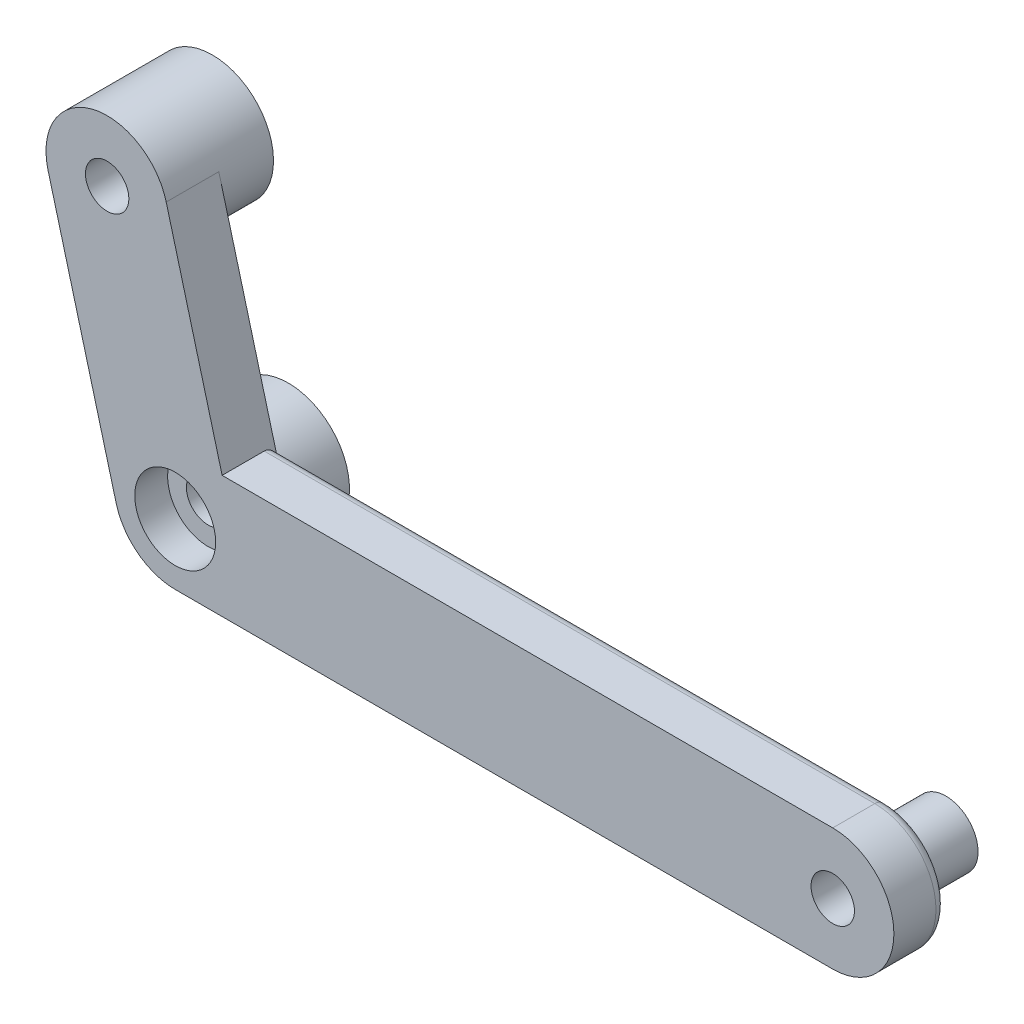
ISO-10303-21;
HEADER;
FILE_DESCRIPTION(('STEP AP214'),'2;1');
FILE_NAME('part.step','',(''),(''),'','','');
FILE_SCHEMA(('AUTOMOTIVE_DESIGN { 1 0 10303 214 1 1 1 1 }'));
ENDSEC;
DATA;
#1=APPLICATION_CONTEXT('core data for automotive mechanical design processes');
#2=APPLICATION_PROTOCOL_DEFINITION('international standard','automotive_design',2000,#1);
#3=PRODUCT_CONTEXT('',#1,'mechanical');
#4=PRODUCT('Part','Part','',(#3));
#5=PRODUCT_RELATED_PRODUCT_CATEGORY('part','',(#4));
#6=PRODUCT_DEFINITION_FORMATION('','',#4);
#7=PRODUCT_DEFINITION_CONTEXT('part definition',#1,'design');
#8=PRODUCT_DEFINITION('design','',#6,#7);
#9=PRODUCT_DEFINITION_SHAPE('','',#8);
#10=(LENGTH_UNIT() NAMED_UNIT(*) SI_UNIT(.MILLI.,.METRE.));
#11=(NAMED_UNIT(*) PLANE_ANGLE_UNIT() SI_UNIT($,.RADIAN.));
#12=(NAMED_UNIT(*) SI_UNIT($,.STERADIAN.) SOLID_ANGLE_UNIT());
#13=UNCERTAINTY_MEASURE_WITH_UNIT(LENGTH_MEASURE(1.E-05),#10,'distance_accuracy_value','');
#14=(GEOMETRIC_REPRESENTATION_CONTEXT(3) GLOBAL_UNCERTAINTY_ASSIGNED_CONTEXT((#13)) GLOBAL_UNIT_ASSIGNED_CONTEXT((#10,
#11,#12)) REPRESENTATION_CONTEXT('',''));
#15=CARTESIAN_POINT('',(0.,0.,0.));
#16=DIRECTION('',(0.,0.,1.));
#17=DIRECTION('',(1.,0.,0.));
#18=AXIS2_PLACEMENT_3D('',#15,#16,#17);
#19=CARTESIAN_POINT('',(-5.17638090205036,19.3185165257814,-30.5138944220067));
#20=DIRECTION('',(0.,0.,1.));
#21=DIRECTION('',(1.,0.,0.));
#22=AXIS2_PLACEMENT_3D('',#19,#20,#21);
#23=CYLINDRICAL_SURFACE('',#22,1.65);
#24=CARTESIAN_POINT('',(-5.17638090205036,19.3185165257814,2.));
#25=DIRECTION('',(0.,0.,1.));
#26=DIRECTION('',(1.,0.,0.));
#27=AXIS2_PLACEMENT_3D('',#24,#25,#26);
#28=CIRCLE('',#27,1.65);
#29=CARTESIAN_POINT('',(-3.52638090205036,19.3185165257814,2.));
#30=VERTEX_POINT('',#29);
#31=EDGE_CURVE('E151',#30,#30,#28,.T.);
#32=ORIENTED_EDGE('',*,*,#31,.T.);
#33=EDGE_LOOP('',(#32));
#34=FACE_BOUND('',#33,.T.);
#35=CARTESIAN_POINT('',(-5.17638090205036,19.3185165257814,-1.));
#36=DIRECTION('',(0.,0.,-1.));
#37=DIRECTION('',(-1.,0.,0.));
#38=AXIS2_PLACEMENT_3D('',#35,#36,#37);
#39=CIRCLE('',#38,1.65);
#40=CARTESIAN_POINT('',(-6.82638090205036,19.3185165257814,-1.));
#41=VERTEX_POINT('',#40);
#42=EDGE_CURVE('E46',#41,#41,#39,.F.);
#43=ORIENTED_EDGE('',*,*,#42,.F.);
#44=EDGE_LOOP('',(#43));
#45=FACE_BOUND('',#44,.T.);
#46=ADVANCED_FACE('F41',(#34,#45),#23,.F.);
#47=CARTESIAN_POINT('',(0.,0.,-2.));
#48=DIRECTION('',(0.,0.,-1.));
#49=DIRECTION('',(-1.,0.,0.));
#50=AXIS2_PLACEMENT_3D('',#47,#48,#49);
#51=PLANE('',#50);
#52=CARTESIAN_POINT('',(50.,0.,-2.));
#53=DIRECTION('',(0.,0.,-1.));
#54=DIRECTION('',(-1.,0.,0.));
#55=AXIS2_PLACEMENT_3D('',#52,#53,#54);
#56=CIRCLE('',#55,3.5);
#57=CARTESIAN_POINT('',(46.5,0.,-2.));
#58=VERTEX_POINT('',#57);
#59=EDGE_CURVE('E175',#58,#58,#56,.T.);
#60=ORIENTED_EDGE('',*,*,#59,.F.);
#61=EDGE_LOOP('',(#60));
#62=FACE_BOUND('',#61,.T.);
#63=DIRECTION('',(0.258819045102518,-0.965925826289069,0.));
#64=VECTOR('',#63,1.);
#65=CARTESIAN_POINT('',(-9.66793599429454,18.1150079660547,-2.));
#66=LINE('',#65,#64);
#67=CARTESIAN_POINT('',(-9.66793599429454,18.1150079660547,-2.));
#68=VERTEX_POINT('',#67);
#69=CARTESIAN_POINT('',(-4.49155509224418,-1.20350855972671,-2.));
#70=VERTEX_POINT('',#69);
#71=EDGE_CURVE('E122',#68,#70,#66,.T.);
#72=ORIENTED_EDGE('',*,*,#71,.F.);
#73=CARTESIAN_POINT('',(-5.17638090205036,19.3185165257814,-2.));
#74=DIRECTION('',(0.,0.,-1.));
#75=DIRECTION('',(-1.,0.,0.));
#76=AXIS2_PLACEMENT_3D('',#73,#74,#75);
#77=CIRCLE('',#76,4.65000000000001);
#78=CARTESIAN_POINT('',(-0.684825809806182,20.5220250855081,-2.));
#79=VERTEX_POINT('',#78);
#80=EDGE_CURVE('E115',#79,#68,#77,.T.);
#81=ORIENTED_EDGE('',*,*,#80,.F.);
#82=DIRECTION('',(-0.258819045102518,0.965925826289069,0.));
#83=VECTOR('',#82,1.);
#84=CARTESIAN_POINT('',(3.56807049410218,4.65,-2.));
#85=LINE('',#84,#83);
#86=CARTESIAN_POINT('',(3.78242984804708,3.85000000000001,-2.));
#87=VERTEX_POINT('',#86);
#88=EDGE_CURVE('E119',#87,#79,#85,.T.);
#89=ORIENTED_EDGE('',*,*,#88,.F.);
#90=DIRECTION('',(-1.,0.,0.));
#91=VECTOR('',#90,1.);
#92=CARTESIAN_POINT('',(50.,3.85,-2.));
#93=LINE('',#92,#91);
#94=CARTESIAN_POINT('',(50.,3.85,-2.));
#95=VERTEX_POINT('',#94);
#96=EDGE_CURVE('E211',#87,#95,#93,.F.);
#97=ORIENTED_EDGE('',*,*,#96,.T.);
#98=CARTESIAN_POINT('',(50.,0.,-2.));
#99=DIRECTION('',(0.,0.,-1.));
#100=DIRECTION('',(-1.,0.,0.));
#101=AXIS2_PLACEMENT_3D('',#98,#99,#100);
#102=CIRCLE('',#101,3.85);
#103=CARTESIAN_POINT('',(50.,-3.85,-2.));
#104=VERTEX_POINT('',#103);
#105=EDGE_CURVE('E209',#95,#104,#102,.T.);
#106=ORIENTED_EDGE('',*,*,#105,.T.);
#107=DIRECTION('',(1.,0.,0.));
#108=VECTOR('',#107,1.);
#109=CARTESIAN_POINT('',(0.,-3.85000000000001,-2.));
#110=LINE('',#109,#108);
#111=CARTESIAN_POINT('',(2.60768096208106,-3.85000000000001,-2.));
#112=VERTEX_POINT('',#111);
#113=EDGE_CURVE('E207',#104,#112,#110,.F.);
#114=ORIENTED_EDGE('',*,*,#113,.T.);
#115=CARTESIAN_POINT('',(0.,0.,-2.));
#116=DIRECTION('',(0.,0.,-1.));
#117=DIRECTION('',(-1.,0.,0.));
#118=AXIS2_PLACEMENT_3D('',#115,#116,#117);
#119=CIRCLE('',#118,4.65000000000001);
#120=EDGE_CURVE('E156',#70,#112,#119,.T.);
#121=ORIENTED_EDGE('',*,*,#120,.F.);
#122=EDGE_LOOP('',(#72,#81,#89,#97,#106,#114,#121));
#123=FACE_BOUND('',#122,.T.);
#124=ADVANCED_FACE('F117',(#62,#123),#51,.T.);
#125=CARTESIAN_POINT('',(0.,0.,2.));
#126=DIRECTION('',(0.,0.,-1.));
#127=DIRECTION('',(-1.,0.,0.));
#128=AXIS2_PLACEMENT_3D('',#125,#126,#127);
#129=CYLINDRICAL_SURFACE('',#128,1.65);
#130=CARTESIAN_POINT('',(0.,0.,-0.5));
#131=DIRECTION('',(0.,0.,1.));
#132=DIRECTION('',(1.,0.,0.));
#133=AXIS2_PLACEMENT_3D('',#130,#131,#132);
#134=CIRCLE('',#133,1.65);
#135=CARTESIAN_POINT('',(1.65,0.,-0.5));
#136=VERTEX_POINT('',#135);
#137=EDGE_CURVE('E165',#136,#136,#134,.T.);
#138=ORIENTED_EDGE('',*,*,#137,.T.);
#139=EDGE_LOOP('',(#138));
#140=FACE_BOUND('',#139,.T.);
#141=CARTESIAN_POINT('',(0.,0.,-6.6));
#142=DIRECTION('',(0.,0.,-1.));
#143=DIRECTION('',(-1.,0.,0.));
#144=AXIS2_PLACEMENT_3D('',#141,#142,#143);
#145=CIRCLE('',#144,1.65);
#146=CARTESIAN_POINT('',(-1.65,0.,-6.6));
#147=VERTEX_POINT('',#146);
#148=EDGE_CURVE('E158',#147,#147,#145,.T.);
#149=ORIENTED_EDGE('',*,*,#148,.T.);
#150=EDGE_LOOP('',(#149));
#151=FACE_BOUND('',#150,.T.);
#152=ADVANCED_FACE('F249',(#140,#151),#129,.F.);
#153=CARTESIAN_POINT('',(50.,0.,-2.4));
#154=DIRECTION('',(0.,0.,-1.));
#155=DIRECTION('',(-1.,0.,0.));
#156=AXIS2_PLACEMENT_3D('',#153,#154,#155);
#157=PLANE('',#156);
#158=CARTESIAN_POINT('',(50.,0.,-2.4));
#159=DIRECTION('',(0.,0.,-1.));
#160=DIRECTION('',(-1.,0.,0.));
#161=AXIS2_PLACEMENT_3D('',#158,#159,#160);
#162=CIRCLE('',#161,3.5);
#163=CARTESIAN_POINT('',(46.5,0.,-2.4));
#164=VERTEX_POINT('',#163);
#165=EDGE_CURVE('E178',#164,#164,#162,.T.);
#166=ORIENTED_EDGE('',*,*,#165,.T.);
#167=EDGE_LOOP('',(#166));
#168=FACE_BOUND('',#167,.T.);
#169=CARTESIAN_POINT('',(50.,0.,-2.4));
#170=DIRECTION('',(0.,0.,-1.));
#171=DIRECTION('',(-1.,0.,0.));
#172=AXIS2_PLACEMENT_3D('',#169,#170,#171);
#173=CIRCLE('',#172,2.45);
#174=CARTESIAN_POINT('',(47.55,0.,-2.4));
#175=VERTEX_POINT('',#174);
#176=EDGE_CURVE('E171',#175,#175,#173,.T.);
#177=ORIENTED_EDGE('',*,*,#176,.F.);
#178=EDGE_LOOP('',(#177));
#179=FACE_BOUND('',#178,.T.);
#180=ADVANCED_FACE('F279',(#168,#179),#157,.T.);
#181=CARTESIAN_POINT('',(0.,0.,2.));
#182=DIRECTION('',(0.,0.,-1.));
#183=DIRECTION('',(-1.,0.,0.));
#184=AXIS2_PLACEMENT_3D('',#181,#182,#183);
#185=PLANE('',#184);
#186=DIRECTION('',(0.258819045102518,-0.965925826289069,0.));
#187=VECTOR('',#186,1.);
#188=CARTESIAN_POINT('',(-9.66793599429454,18.1150079660547,2.));
#189=LINE('',#188,#187);
#190=CARTESIAN_POINT('',(-9.66793599429454,18.1150079660547,2.));
#191=VERTEX_POINT('',#190);
#192=CARTESIAN_POINT('',(-4.49155509224418,-1.20350855972671,2.));
#193=VERTEX_POINT('',#192);
#194=EDGE_CURVE('E161',#191,#193,#189,.T.);
#195=ORIENTED_EDGE('',*,*,#194,.T.);
#196=CARTESIAN_POINT('',(0.,0.,2.));
#197=DIRECTION('',(0.,0.,1.));
#198=DIRECTION('',(-1.,0.,0.));
#199=AXIS2_PLACEMENT_3D('',#196,#197,#198);
#200=CIRCLE('',#199,4.65000000000001);
#201=CARTESIAN_POINT('',(0.,-4.65000000000001,2.));
#202=VERTEX_POINT('',#201);
#203=EDGE_CURVE('E186',#193,#202,#200,.T.);
#204=ORIENTED_EDGE('',*,*,#203,.T.);
#205=DIRECTION('',(1.,0.,0.));
#206=VECTOR('',#205,1.);
#207=CARTESIAN_POINT('',(50.,-4.65,2.));
#208=LINE('',#207,#206);
#209=CARTESIAN_POINT('',(50.,-4.65,2.));
#210=VERTEX_POINT('',#209);
#211=EDGE_CURVE('E188',#202,#210,#208,.T.);
#212=ORIENTED_EDGE('',*,*,#211,.T.);
#213=CARTESIAN_POINT('',(50.,0.,2.));
#214=DIRECTION('',(0.,0.,1.));
#215=DIRECTION('',(-1.,0.,0.));
#216=AXIS2_PLACEMENT_3D('',#213,#214,#215);
#217=CIRCLE('',#216,4.65);
#218=CARTESIAN_POINT('',(50.,4.65,2.));
#219=VERTEX_POINT('',#218);
#220=EDGE_CURVE('E190',#210,#219,#217,.T.);
#221=ORIENTED_EDGE('',*,*,#220,.T.);
#222=DIRECTION('',(-1.,0.,0.));
#223=VECTOR('',#222,1.);
#224=CARTESIAN_POINT('',(0.,4.65000000000001,2.));
#225=LINE('',#224,#223);
#226=CARTESIAN_POINT('',(3.56807049410218,4.65000000000001,2.));
#227=VERTEX_POINT('',#226);
#228=EDGE_CURVE('E192',#219,#227,#225,.T.);
#229=ORIENTED_EDGE('',*,*,#228,.T.);
#230=DIRECTION('',(-0.258819045102518,0.965925826289069,0.));
#231=VECTOR('',#230,1.);
#232=CARTESIAN_POINT('',(3.56807049410218,4.65,2.));
#233=LINE('',#232,#231);
#234=CARTESIAN_POINT('',(-0.684825809806184,20.5220250855081,2.));
#235=VERTEX_POINT('',#234);
#236=EDGE_CURVE('E317',#227,#235,#233,.T.);
#237=ORIENTED_EDGE('',*,*,#236,.T.);
#238=CARTESIAN_POINT('',(-5.17638090205036,19.3185165257814,2.));
#239=DIRECTION('',(0.,0.,1.));
#240=DIRECTION('',(-1.,0.,0.));
#241=AXIS2_PLACEMENT_3D('',#238,#239,#240);
#242=CIRCLE('',#241,4.65000000000001);
#243=EDGE_CURVE('E132',#235,#191,#242,.T.);
#244=ORIENTED_EDGE('',*,*,#243,.T.);
#245=EDGE_LOOP('',(#195,#204,#212,#221,#229,#237,#244));
#246=FACE_BOUND('',#245,.T.);
#247=CARTESIAN_POINT('',(0.,0.,2.));
#248=DIRECTION('',(0.,0.,1.));
#249=DIRECTION('',(1.,0.,0.));
#250=AXIS2_PLACEMENT_3D('',#247,#248,#249);
#251=CIRCLE('',#250,3.075);
#252=CARTESIAN_POINT('',(3.075,0.,2.));
#253=VERTEX_POINT('',#252);
#254=EDGE_CURVE('E155',#253,#253,#251,.T.);
#255=ORIENTED_EDGE('',*,*,#254,.F.);
#256=EDGE_LOOP('',(#255));
#257=FACE_BOUND('',#256,.T.);
#258=CARTESIAN_POINT('',(50.,0.,2.));
#259=DIRECTION('',(0.,0.,1.));
#260=DIRECTION('',(1.,0.,0.));
#261=AXIS2_PLACEMENT_3D('',#258,#259,#260);
#262=CIRCLE('',#261,1.65);
#263=CARTESIAN_POINT('',(51.65,0.,2.));
#264=VERTEX_POINT('',#263);
#265=EDGE_CURVE('E181',#264,#264,#262,.T.);
#266=ORIENTED_EDGE('',*,*,#265,.F.);
#267=EDGE_LOOP('',(#266));
#268=FACE_BOUND('',#267,.T.);
#269=ORIENTED_EDGE('',*,*,#31,.F.);
#270=EDGE_LOOP('',(#269));
#271=FACE_BOUND('',#270,.T.);
#272=ADVANCED_FACE('F229',(#246,#257,#268,#271),#185,.F.);
#273=CARTESIAN_POINT('',(0.,0.,2.));
#274=DIRECTION('',(0.,0.,-1.));
#275=DIRECTION('',(-1.,0.,0.));
#276=AXIS2_PLACEMENT_3D('',#273,#274,#275);
#277=CYLINDRICAL_SURFACE('',#276,4.65000000000001);
#278=ORIENTED_EDGE('',*,*,#203,.F.);
#279=DIRECTION('',(0.,0.,1.));
#280=VECTOR('',#279,1.);
#281=CARTESIAN_POINT('',(-4.49155509224418,-1.20350855972671,-30.5138944220067));
#282=LINE('',#281,#280);
#283=EDGE_CURVE('E143',#70,#193,#282,.T.);
#284=ORIENTED_EDGE('',*,*,#283,.F.);
#285=ORIENTED_EDGE('',*,*,#120,.T.);
#286=CARTESIAN_POINT('',(2.60768096208106,-3.85000000000001,-2.));
#287=CARTESIAN_POINT('',(2.5513965252021,-3.88813137176407,-1.99996722502636));
#288=CARTESIAN_POINT('',(2.49432087615377,-3.92498071993976,-1.99727709721067));
#289=CARTESIAN_POINT('',(2.37898870856653,-3.99593171285262,-1.98739878891353));
#290=CARTESIAN_POINT('',(2.32073434321973,-4.03003788547599,-1.98021819980612));
#291=CARTESIAN_POINT('',(2.20358244707727,-4.09526565632877,-1.96222044302445));
#292=CARTESIAN_POINT('',(2.14469032392126,-4.12640285649458,-1.95142380524581));
#293=CARTESIAN_POINT('',(2.02611438187092,-4.18590056123308,-1.92677933604008));
#294=CARTESIAN_POINT('',(1.96643010844688,-4.21425938579435,-1.91292967477712));
#295=CARTESIAN_POINT('',(1.80093924809649,-4.28864672714957,-1.87122884887268));
#296=CARTESIAN_POINT('',(1.69447909826136,-4.33176651109045,-1.84072438234376));
#297=CARTESIAN_POINT('',(1.48029183010364,-4.40956231079718,-1.77403250103863));
#298=CARTESIAN_POINT('',(1.37256408539743,-4.4442339509555,-1.73784215722787));
#299=CARTESIAN_POINT('',(1.04738977003664,-4.5361105994101,-1.6229669528191));
#300=CARTESIAN_POINT('',(0.828476483261017,-4.58094551480499,-1.53812626936352));
#301=CARTESIAN_POINT('',(0.509799811949458,-4.62305646126751,-1.41010805397757));
#302=CARTESIAN_POINT('',(0.410362390780079,-4.6329321901987,-1.36952593129161));
#303=CARTESIAN_POINT('',(0.211472913276468,-4.64625532318511,-1.28770315979258));
#304=CARTESIAN_POINT('',(0.112021166643062,-4.64971358046947,-1.24646374198126));
#305=CARTESIAN_POINT('',(0.00839829202350861,-4.64999431212968,-1.20348344531256));
#306=CARTESIAN_POINT('',(0.00419911645483577,-4.65000000000074,-1.20174170819417));
#307=CARTESIAN_POINT('',(0.,-4.65000000000001,-1.2));
#308=B_SPLINE_CURVE_WITH_KNOTS('',3,(#286,#287,#288,#289,#290,#291,#292,#293,#294,#295,#296,
#297,#298,#299,#300,#301,#302,#303,#304,#305,#306,#307),.UNSPECIFIED.,.F.,.F.,(4,2,2,2,2,2,2,2,
2,2,4),(0.,0.203795375207023,0.407247150944995,0.609562887954329,0.812000214607053,
1.16795216229696,1.52408808069821,2.23811721837387,2.5615716210759,2.8844784973427,
2.89811668971625),.UNSPECIFIED.);
#309=CARTESIAN_POINT('',(0.,-4.65000000000001,-1.2));
#310=VERTEX_POINT('',#309);
#311=EDGE_CURVE('E11',#112,#310,#308,.T.);
#312=ORIENTED_EDGE('',*,*,#311,.T.);
#313=DIRECTION('',(0.,0.,-1.));
#314=VECTOR('',#313,1.);
#315=CARTESIAN_POINT('',(0.,-4.65000000000001,2.));
#316=LINE('',#315,#314);
#317=EDGE_CURVE('E200',#202,#310,#316,.T.);
#318=ORIENTED_EDGE('',*,*,#317,.F.);
#319=EDGE_LOOP('',(#278,#284,#285,#312,#318));
#320=FACE_BOUND('',#319,.T.);
#321=CARTESIAN_POINT('',(0.,0.,-6.6));
#322=DIRECTION('',(0.,0.,-1.));
#323=DIRECTION('',(-1.,0.,0.));
#324=AXIS2_PLACEMENT_3D('',#321,#322,#323);
#325=CIRCLE('',#324,4.65000000000001);
#326=CARTESIAN_POINT('',(-4.65000000000001,0.,-6.6));
#327=VERTEX_POINT('',#326);
#328=EDGE_CURVE('E152',#327,#327,#325,.T.);
#329=ORIENTED_EDGE('',*,*,#328,.F.);
#330=EDGE_LOOP('',(#329));
#331=FACE_BOUND('',#330,.T.);
#332=ADVANCED_FACE('F223',(#320,#331),#277,.T.);
#333=CARTESIAN_POINT('',(50.,-4.65,2.));
#334=DIRECTION('',(0.,1.,0.));
#335=DIRECTION('',(-1.,0.,0.));
#336=AXIS2_PLACEMENT_3D('',#333,#334,#335);
#337=PLANE('',#336);
#338=ORIENTED_EDGE('',*,*,#317,.T.);
#339=DIRECTION('',(1.,0.,0.));
#340=VECTOR('',#339,1.);
#341=CARTESIAN_POINT('',(50.,-4.65,-1.2));
#342=LINE('',#341,#340);
#343=CARTESIAN_POINT('',(50.,-4.65,-1.2));
#344=VERTEX_POINT('',#343);
#345=EDGE_CURVE('E64',#310,#344,#342,.T.);
#346=ORIENTED_EDGE('',*,*,#345,.T.);
#347=DIRECTION('',(0.,0.,-1.));
#348=VECTOR('',#347,1.);
#349=CARTESIAN_POINT('',(50.,-4.65,2.));
#350=LINE('',#349,#348);
#351=EDGE_CURVE('E198',#210,#344,#350,.T.);
#352=ORIENTED_EDGE('',*,*,#351,.F.);
#353=ORIENTED_EDGE('',*,*,#211,.F.);
#354=EDGE_LOOP('',(#338,#346,#352,#353));
#355=FACE_BOUND('',#354,.T.);
#356=ADVANCED_FACE('F228',(#355),#337,.F.);
#357=CARTESIAN_POINT('',(50.,0.,2.));
#358=DIRECTION('',(0.,0.,-1.));
#359=DIRECTION('',(-1.,0.,0.));
#360=AXIS2_PLACEMENT_3D('',#357,#358,#359);
#361=CYLINDRICAL_SURFACE('',#360,4.65);
#362=ORIENTED_EDGE('',*,*,#351,.T.);
#363=CARTESIAN_POINT('',(50.,0.,-1.2));
#364=DIRECTION('',(0.,0.,-1.));
#365=DIRECTION('',(-1.,0.,0.));
#366=AXIS2_PLACEMENT_3D('',#363,#364,#365);
#367=CIRCLE('',#366,4.65);
#368=CARTESIAN_POINT('',(50.,4.65,-1.2));
#369=VERTEX_POINT('',#368);
#370=EDGE_CURVE('E213',#344,#369,#367,.F.);
#371=ORIENTED_EDGE('',*,*,#370,.T.);
#372=DIRECTION('',(0.,0.,-1.));
#373=VECTOR('',#372,1.);
#374=CARTESIAN_POINT('',(50.,4.65,2.));
#375=LINE('',#374,#373);
#376=EDGE_CURVE('E195',#219,#369,#375,.T.);
#377=ORIENTED_EDGE('',*,*,#376,.F.);
#378=ORIENTED_EDGE('',*,*,#220,.F.);
#379=EDGE_LOOP('',(#362,#371,#377,#378));
#380=FACE_BOUND('',#379,.T.);
#381=ADVANCED_FACE('F298',(#380),#361,.T.);
#382=CARTESIAN_POINT('',(0.,4.65000000000001,2.));
#383=DIRECTION('',(0.,-1.,0.));
#384=DIRECTION('',(1.,0.,0.));
#385=AXIS2_PLACEMENT_3D('',#382,#383,#384);
#386=PLANE('',#385);
#387=ORIENTED_EDGE('',*,*,#376,.T.);
#388=DIRECTION('',(-1.,0.,0.));
#389=VECTOR('',#388,1.);
#390=CARTESIAN_POINT('',(3.56807049410218,4.65000000000001,-1.2));
#391=LINE('',#390,#389);
#392=CARTESIAN_POINT('',(3.56807049410218,4.65,-1.2));
#393=VERTEX_POINT('',#392);
#394=EDGE_CURVE('E202',#369,#393,#391,.T.);
#395=ORIENTED_EDGE('',*,*,#394,.T.);
#396=DIRECTION('',(0.,0.,1.));
#397=VECTOR('',#396,1.);
#398=CARTESIAN_POINT('',(3.56807049410218,4.65,-30.5138944220067));
#399=LINE('',#398,#397);
#400=EDGE_CURVE('E136',#393,#227,#399,.T.);
#401=ORIENTED_EDGE('',*,*,#400,.T.);
#402=ORIENTED_EDGE('',*,*,#228,.F.);
#403=EDGE_LOOP('',(#387,#395,#401,#402));
#404=FACE_BOUND('',#403,.T.);
#405=ADVANCED_FACE('F292',(#404),#386,.F.);
#406=CARTESIAN_POINT('',(50.,0.,2.));
#407=DIRECTION('',(0.,0.,-1.));
#408=DIRECTION('',(-1.,0.,0.));
#409=AXIS2_PLACEMENT_3D('',#406,#407,#408);
#410=CYLINDRICAL_SURFACE('',#409,1.65);
#411=ORIENTED_EDGE('',*,*,#265,.T.);
#412=EDGE_LOOP('',(#411));
#413=FACE_BOUND('',#412,.T.);
#414=CARTESIAN_POINT('',(50.,0.,-6.6));
#415=DIRECTION('',(0.,0.,-1.));
#416=DIRECTION('',(-1.,0.,0.));
#417=AXIS2_PLACEMENT_3D('',#414,#415,#416);
#418=CIRCLE('',#417,1.65);
#419=CARTESIAN_POINT('',(48.35,0.,-6.6));
#420=VERTEX_POINT('',#419);
#421=EDGE_CURVE('E168',#420,#420,#418,.T.);
#422=ORIENTED_EDGE('',*,*,#421,.T.);
#423=EDGE_LOOP('',(#422));
#424=FACE_BOUND('',#423,.T.);
#425=ADVANCED_FACE('F285',(#413,#424),#410,.F.);
#426=CARTESIAN_POINT('',(50.,0.,-2.4));
#427=DIRECTION('',(0.,0.,1.));
#428=DIRECTION('',(1.,0.,0.));
#429=AXIS2_PLACEMENT_3D('',#426,#427,#428);
#430=CYLINDRICAL_SURFACE('',#429,3.5);
#431=ORIENTED_EDGE('',*,*,#165,.F.);
#432=EDGE_LOOP('',(#431));
#433=FACE_BOUND('',#432,.T.);
#434=ORIENTED_EDGE('',*,*,#59,.T.);
#435=EDGE_LOOP('',(#434));
#436=FACE_BOUND('',#435,.T.);
#437=ADVANCED_FACE('F274',(#433,#436),#430,.T.);
#438=CARTESIAN_POINT('',(50.,0.,-6.6));
#439=DIRECTION('',(0.,0.,-1.));
#440=DIRECTION('',(-1.,0.,0.));
#441=AXIS2_PLACEMENT_3D('',#438,#439,#440);
#442=PLANE('',#441);
#443=CARTESIAN_POINT('',(50.,0.,-6.6));
#444=DIRECTION('',(0.,0.,-1.));
#445=DIRECTION('',(-1.,0.,0.));
#446=AXIS2_PLACEMENT_3D('',#443,#444,#445);
#447=CIRCLE('',#446,2.45);
#448=CARTESIAN_POINT('',(47.55,0.,-6.6));
#449=VERTEX_POINT('',#448);
#450=EDGE_CURVE('E172',#449,#449,#447,.T.);
#451=ORIENTED_EDGE('',*,*,#450,.T.);
#452=EDGE_LOOP('',(#451));
#453=FACE_BOUND('',#452,.T.);
#454=ORIENTED_EDGE('',*,*,#421,.F.);
#455=EDGE_LOOP('',(#454));
#456=FACE_BOUND('',#455,.T.);
#457=ADVANCED_FACE('F271',(#453,#456),#442,.T.);
#458=CARTESIAN_POINT('',(50.,0.,-6.6));
#459=DIRECTION('',(0.,0.,1.));
#460=DIRECTION('',(1.,0.,0.));
#461=AXIS2_PLACEMENT_3D('',#458,#459,#460);
#462=CYLINDRICAL_SURFACE('',#461,2.45);
#463=ORIENTED_EDGE('',*,*,#450,.F.);
#464=EDGE_LOOP('',(#463));
#465=FACE_BOUND('',#464,.T.);
#466=ORIENTED_EDGE('',*,*,#176,.T.);
#467=EDGE_LOOP('',(#466));
#468=FACE_BOUND('',#467,.T.);
#469=ADVANCED_FACE('F269',(#465,#468),#462,.T.);
#470=CARTESIAN_POINT('',(0.,0.,-0.5));
#471=DIRECTION('',(0.,0.,1.));
#472=DIRECTION('',(1.,0.,0.));
#473=AXIS2_PLACEMENT_3D('',#470,#471,#472);
#474=CYLINDRICAL_SURFACE('',#473,3.075);
#475=CARTESIAN_POINT('',(0.,0.,-0.5));
#476=DIRECTION('',(0.,0.,1.));
#477=DIRECTION('',(1.,0.,0.));
#478=AXIS2_PLACEMENT_3D('',#475,#476,#477);
#479=CIRCLE('',#478,3.075);
#480=CARTESIAN_POINT('',(3.075,0.,-0.5));
#481=VERTEX_POINT('',#480);
#482=EDGE_CURVE('E162',#481,#481,#479,.T.);
#483=ORIENTED_EDGE('',*,*,#482,.F.);
#484=EDGE_LOOP('',(#483));
#485=FACE_BOUND('',#484,.T.);
#486=ORIENTED_EDGE('',*,*,#254,.T.);
#487=EDGE_LOOP('',(#486));
#488=FACE_BOUND('',#487,.T.);
#489=ADVANCED_FACE('F265',(#485,#488),#474,.F.);
#490=CARTESIAN_POINT('',(0.,0.,-0.5));
#491=DIRECTION('',(0.,0.,1.));
#492=DIRECTION('',(1.,0.,0.));
#493=AXIS2_PLACEMENT_3D('',#490,#491,#492);
#494=PLANE('',#493);
#495=ORIENTED_EDGE('',*,*,#137,.F.);
#496=EDGE_LOOP('',(#495));
#497=FACE_BOUND('',#496,.T.);
#498=ORIENTED_EDGE('',*,*,#482,.T.);
#499=EDGE_LOOP('',(#498));
#500=FACE_BOUND('',#499,.T.);
#501=ADVANCED_FACE('F261',(#497,#500),#494,.T.);
#502=CARTESIAN_POINT('',(50.,0.,-6.6));
#503=DIRECTION('',(0.,0.,-1.));
#504=DIRECTION('',(-1.,0.,0.));
#505=AXIS2_PLACEMENT_3D('',#502,#503,#504);
#506=PLANE('',#505);
#507=ORIENTED_EDGE('',*,*,#148,.F.);
#508=EDGE_LOOP('',(#507));
#509=FACE_BOUND('',#508,.T.);
#510=ORIENTED_EDGE('',*,*,#328,.T.);
#511=EDGE_LOOP('',(#510));
#512=FACE_BOUND('',#511,.T.);
#513=ADVANCED_FACE('F258',(#509,#512),#506,.T.);
#514=CARTESIAN_POINT('',(-9.66793599429454,18.1150079660547,-30.5138944220067));
#515=DIRECTION('',(-0.965925826289069,-0.258819045102518,0.));
#516=DIRECTION('',(0.258819045102518,-0.965925826289069,0.));
#517=AXIS2_PLACEMENT_3D('',#514,#515,#516);
#518=PLANE('',#517);
#519=DIRECTION('',(0.,0.,1.));
#520=VECTOR('',#519,1.);
#521=CARTESIAN_POINT('',(-9.66793599429454,18.1150079660547,-30.5138944220067));
#522=LINE('',#521,#520);
#523=EDGE_CURVE('E141',#68,#191,#522,.T.);
#524=ORIENTED_EDGE('',*,*,#523,.F.);
#525=ORIENTED_EDGE('',*,*,#71,.T.);
#526=ORIENTED_EDGE('',*,*,#283,.T.);
#527=ORIENTED_EDGE('',*,*,#194,.F.);
#528=EDGE_LOOP('',(#524,#525,#526,#527));
#529=FACE_BOUND('',#528,.T.);
#530=ADVANCED_FACE('F256',(#529),#518,.T.);
#531=CARTESIAN_POINT('',(-5.17638090205036,19.3185165257814,-30.5138944220067));
#532=DIRECTION('',(0.,0.,1.));
#533=DIRECTION('',(1.,0.,0.));
#534=AXIS2_PLACEMENT_3D('',#531,#532,#533);
#535=CYLINDRICAL_SURFACE('',#534,4.65000000000001);
#536=DIRECTION('',(0.,0.,1.));
#537=VECTOR('',#536,1.);
#538=CARTESIAN_POINT('',(-0.684825809806184,20.5220250855081,-30.5138944220067));
#539=LINE('',#538,#537);
#540=EDGE_CURVE('E128',#79,#235,#539,.T.);
#541=ORIENTED_EDGE('',*,*,#540,.F.);
#542=ORIENTED_EDGE('',*,*,#80,.T.);
#543=ORIENTED_EDGE('',*,*,#523,.T.);
#544=ORIENTED_EDGE('',*,*,#243,.F.);
#545=EDGE_LOOP('',(#541,#542,#543,#544));
#546=FACE_BOUND('',#545,.T.);
#547=CARTESIAN_POINT('',(-5.17638090205036,19.3185165257814,-6.));
#548=DIRECTION('',(0.,0.,-1.));
#549=DIRECTION('',(-1.,0.,0.));
#550=AXIS2_PLACEMENT_3D('',#547,#548,#549);
#551=CIRCLE('',#550,4.65000000000001);
#552=CARTESIAN_POINT('',(-9.82638090205037,19.3185165257814,-6.));
#553=VERTEX_POINT('',#552);
#554=EDGE_CURVE('E125',#553,#553,#551,.T.);
#555=ORIENTED_EDGE('',*,*,#554,.F.);
#556=EDGE_LOOP('',(#555));
#557=FACE_BOUND('',#556,.T.);
#558=ADVANCED_FACE('F129',(#546,#557),#535,.T.);
#559=CARTESIAN_POINT('',(3.56807049410218,4.65,-30.5138944220067));
#560=DIRECTION('',(0.965925826289069,0.258819045102518,0.));
#561=DIRECTION('',(-0.258819045102518,0.965925826289069,0.));
#562=AXIS2_PLACEMENT_3D('',#559,#560,#561);
#563=PLANE('',#562);
#564=ORIENTED_EDGE('',*,*,#400,.F.);
#565=CARTESIAN_POINT('',(3.78242984804708,3.85000000000001,-1.2));
#566=DIRECTION('',(0.965925826289069,0.258819045102518,0.));
#567=DIRECTION('',(0.258819045102518,-0.965925826289069,0.));
#568=AXIS2_PLACEMENT_3D('',#565,#566,#567);
#569=ELLIPSE('',#568,0.828220944328066,0.8);
#570=EDGE_CURVE('E51',#393,#87,#569,.F.);
#571=ORIENTED_EDGE('',*,*,#570,.T.);
#572=ORIENTED_EDGE('',*,*,#88,.T.);
#573=ORIENTED_EDGE('',*,*,#540,.T.);
#574=ORIENTED_EDGE('',*,*,#236,.F.);
#575=EDGE_LOOP('',(#564,#571,#572,#573,#574));
#576=FACE_BOUND('',#575,.T.);
#577=ADVANCED_FACE('F139',(#576),#563,.T.);
#578=CARTESIAN_POINT('',(50.,-3.85,-1.2));
#579=DIRECTION('',(-1.,0.,0.));
#580=DIRECTION('',(0.,-1.,0.));
#581=AXIS2_PLACEMENT_3D('',#578,#579,#580);
#582=CYLINDRICAL_SURFACE('',#581,0.8);
#583=ORIENTED_EDGE('',*,*,#311,.F.);
#584=ORIENTED_EDGE('',*,*,#113,.F.);
#585=CARTESIAN_POINT('',(50.,-3.85,-1.2));
#586=DIRECTION('',(1.,0.,0.));
#587=DIRECTION('',(0.,0.,-1.));
#588=AXIS2_PLACEMENT_3D('',#585,#586,#587);
#589=CIRCLE('',#588,0.8);
#590=EDGE_CURVE('E311',#344,#104,#589,.T.);
#591=ORIENTED_EDGE('',*,*,#590,.F.);
#592=ORIENTED_EDGE('',*,*,#345,.F.);
#593=EDGE_LOOP('',(#583,#584,#591,#592));
#594=FACE_BOUND('',#593,.T.);
#595=ADVANCED_FACE('F43',(#594),#582,.T.);
#596=CARTESIAN_POINT('',(50.,0.,-1.2));
#597=DIRECTION('',(0.,0.,-1.));
#598=DIRECTION('',(-1.,0.,0.));
#599=AXIS2_PLACEMENT_3D('',#596,#597,#598);
#600=TOROIDAL_SURFACE('',#599,3.85,0.8);
#601=ORIENTED_EDGE('',*,*,#590,.T.);
#602=ORIENTED_EDGE('',*,*,#105,.F.);
#603=CARTESIAN_POINT('',(50.,3.85,-1.2));
#604=DIRECTION('',(-1.,0.,0.));
#605=DIRECTION('',(0.,0.,1.));
#606=AXIS2_PLACEMENT_3D('',#603,#604,#605);
#607=CIRCLE('',#606,0.8);
#608=EDGE_CURVE('E222',#369,#95,#607,.T.);
#609=ORIENTED_EDGE('',*,*,#608,.F.);
#610=ORIENTED_EDGE('',*,*,#370,.F.);
#611=EDGE_LOOP('',(#601,#602,#609,#610));
#612=FACE_BOUND('',#611,.T.);
#613=ADVANCED_FACE('F234',(#612),#600,.T.);
#614=CARTESIAN_POINT('',(0.,3.85000000000001,-1.2));
#615=DIRECTION('',(1.,0.,0.));
#616=DIRECTION('',(0.,1.,0.));
#617=AXIS2_PLACEMENT_3D('',#614,#615,#616);
#618=CYLINDRICAL_SURFACE('',#617,0.8);
#619=ORIENTED_EDGE('',*,*,#608,.T.);
#620=ORIENTED_EDGE('',*,*,#96,.F.);
#621=ORIENTED_EDGE('',*,*,#570,.F.);
#622=ORIENTED_EDGE('',*,*,#394,.F.);
#623=EDGE_LOOP('',(#619,#620,#621,#622));
#624=FACE_BOUND('',#623,.T.);
#625=ADVANCED_FACE('F231',(#624),#618,.T.);
#626=CARTESIAN_POINT('',(-5.17638090205036,19.3185165257814,-6.));
#627=DIRECTION('',(0.,0.,-1.));
#628=DIRECTION('',(-1.,0.,0.));
#629=AXIS2_PLACEMENT_3D('',#626,#627,#628);
#630=PLANE('',#629);
#631=CARTESIAN_POINT('',(-5.17638090205036,19.3185165257814,-6.));
#632=DIRECTION('',(0.,0.,-1.));
#633=DIRECTION('',(-1.,0.,0.));
#634=AXIS2_PLACEMENT_3D('',#631,#632,#633);
#635=CIRCLE('',#634,2.1);
#636=CARTESIAN_POINT('',(-7.27638090205036,19.3185165257814,-6.));
#637=VERTEX_POINT('',#636);
#638=EDGE_CURVE('E325',#637,#637,#635,.T.);
#639=ORIENTED_EDGE('',*,*,#638,.F.);
#640=EDGE_LOOP('',(#639));
#641=FACE_BOUND('',#640,.T.);
#642=ORIENTED_EDGE('',*,*,#554,.T.);
#643=EDGE_LOOP('',(#642));
#644=FACE_BOUND('',#643,.T.);
#645=ADVANCED_FACE('F233',(#641,#644),#630,.T.);
#646=CARTESIAN_POINT('',(-5.17638090205036,19.3185165257814,-1.));
#647=DIRECTION('',(0.,0.,-1.));
#648=DIRECTION('',(-1.,0.,0.));
#649=AXIS2_PLACEMENT_3D('',#646,#647,#648);
#650=PLANE('',#649);
#651=CARTESIAN_POINT('',(-5.17638090205036,19.3185165257814,-1.));
#652=DIRECTION('',(0.,0.,-1.));
#653=DIRECTION('',(-1.,0.,0.));
#654=AXIS2_PLACEMENT_3D('',#651,#652,#653);
#655=CIRCLE('',#654,2.1);
#656=CARTESIAN_POINT('',(-7.27638090205036,19.3185165257814,-1.));
#657=VERTEX_POINT('',#656);
#658=EDGE_CURVE('E328',#657,#657,#655,.T.);
#659=ORIENTED_EDGE('',*,*,#658,.T.);
#660=EDGE_LOOP('',(#659));
#661=FACE_BOUND('',#660,.T.);
#662=ORIENTED_EDGE('',*,*,#42,.T.);
#663=EDGE_LOOP('',(#662));
#664=FACE_BOUND('',#663,.T.);
#665=ADVANCED_FACE('F335',(#661,#664),#650,.T.);
#666=CARTESIAN_POINT('',(-5.17638090205036,19.3185165257814,-1.));
#667=DIRECTION('',(0.,0.,-1.));
#668=DIRECTION('',(-1.,0.,0.));
#669=AXIS2_PLACEMENT_3D('',#666,#667,#668);
#670=CYLINDRICAL_SURFACE('',#669,2.1);
#671=ORIENTED_EDGE('',*,*,#658,.F.);
#672=EDGE_LOOP('',(#671));
#673=FACE_BOUND('',#672,.T.);
#674=ORIENTED_EDGE('',*,*,#638,.T.);
#675=EDGE_LOOP('',(#674));
#676=FACE_BOUND('',#675,.T.);
#677=ADVANCED_FACE('F337',(#673,#676),#670,.F.);
#678=CLOSED_SHELL('',(#46,#124,#152,#180,#272,#332,#356,#381,#405,#425,#437,#457,#469,#489,#501,
#513,#530,#558,#577,#595,#613,#625,#645,#665,#677));
#679=MANIFOLD_SOLID_BREP('B2',#678);
#680=ADVANCED_BREP_SHAPE_REPRESENTATION('',(#18,#679),#14);
#681=SHAPE_DEFINITION_REPRESENTATION(#9,#680);
ENDSEC;
END-ISO-10303-21;
